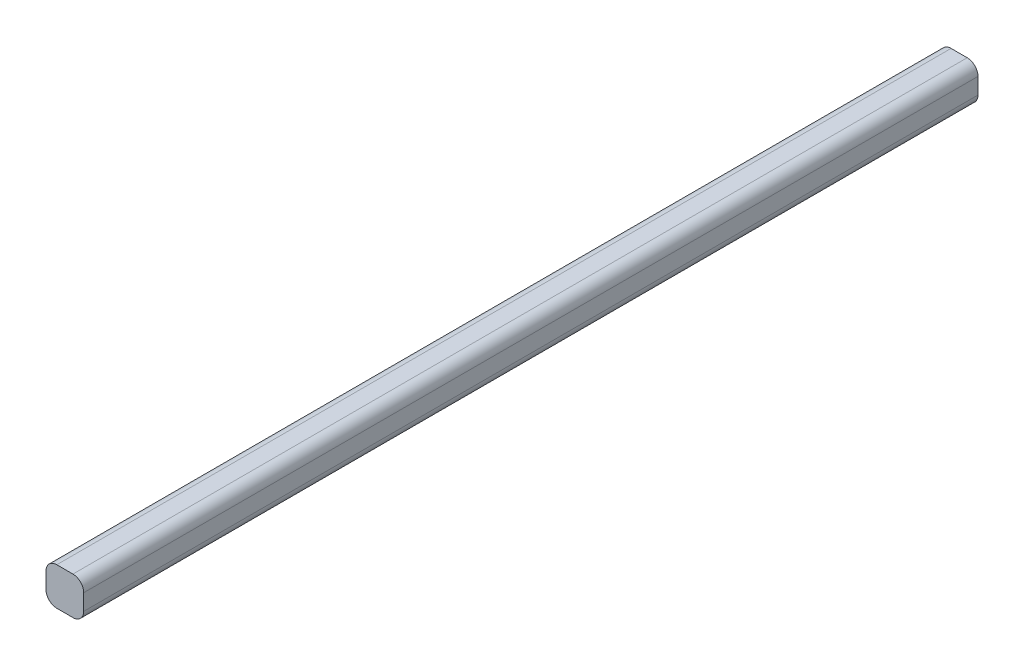
ISO-10303-21;
HEADER;
FILE_DESCRIPTION(('STEP AP214'),'2;1');
FILE_NAME('part.step','',(''),(''),'','','');
FILE_SCHEMA(('AUTOMOTIVE_DESIGN { 1 0 10303 214 1 1 1 1 }'));
ENDSEC;
DATA;
#1=APPLICATION_CONTEXT('core data for automotive mechanical design processes');
#2=APPLICATION_PROTOCOL_DEFINITION('international standard','automotive_design',2000,#1);
#3=PRODUCT_CONTEXT('',#1,'mechanical');
#4=PRODUCT('Part','Part','',(#3));
#5=PRODUCT_RELATED_PRODUCT_CATEGORY('part','',(#4));
#6=PRODUCT_DEFINITION_FORMATION('','',#4);
#7=PRODUCT_DEFINITION_CONTEXT('part definition',#1,'design');
#8=PRODUCT_DEFINITION('design','',#6,#7);
#9=PRODUCT_DEFINITION_SHAPE('','',#8);
#10=(LENGTH_UNIT() NAMED_UNIT(*) SI_UNIT(.MILLI.,.METRE.));
#11=(NAMED_UNIT(*) PLANE_ANGLE_UNIT() SI_UNIT($,.RADIAN.));
#12=(NAMED_UNIT(*) SI_UNIT($,.STERADIAN.) SOLID_ANGLE_UNIT());
#13=UNCERTAINTY_MEASURE_WITH_UNIT(LENGTH_MEASURE(1.E-05),#10,'distance_accuracy_value','');
#14=(GEOMETRIC_REPRESENTATION_CONTEXT(3) GLOBAL_UNCERTAINTY_ASSIGNED_CONTEXT((#13)) GLOBAL_UNIT_ASSIGNED_CONTEXT((#10,
#11,#12)) REPRESENTATION_CONTEXT('',''));
#15=CARTESIAN_POINT('',(0.,0.,0.));
#16=DIRECTION('',(0.,0.,1.));
#17=DIRECTION('',(1.,0.,0.));
#18=AXIS2_PLACEMENT_3D('',#15,#16,#17);
#19=CARTESIAN_POINT('',(0.,0.,830.));
#20=DIRECTION('',(1.,0.,0.));
#21=DIRECTION('',(0.,0.,-1.));
#22=AXIS2_PLACEMENT_3D('',#19,#20,#21);
#23=PLANE('',#22);
#24=DIRECTION('',(0.,-1.,0.));
#25=VECTOR('',#24,1.);
#26=CARTESIAN_POINT('',(0.,0.,0.));
#27=LINE('',#26,#25);
#28=CARTESIAN_POINT('',(0.,25.,0.));
#29=VERTEX_POINT('',#28);
#30=CARTESIAN_POINT('',(0.,10.,0.));
#31=VERTEX_POINT('',#30);
#32=EDGE_CURVE('E133',#29,#31,#27,.T.);
#33=ORIENTED_EDGE('',*,*,#32,.T.);
#34=DIRECTION('',(0.,0.,-1.));
#35=VECTOR('',#34,1.);
#36=CARTESIAN_POINT('',(0.,10.,830.));
#37=LINE('',#36,#35);
#38=CARTESIAN_POINT('',(0.,10.,830.));
#39=VERTEX_POINT('',#38);
#40=EDGE_CURVE('E110',#31,#39,#37,.F.);
#41=ORIENTED_EDGE('',*,*,#40,.T.);
#42=DIRECTION('',(0.,-1.,0.));
#43=VECTOR('',#42,1.);
#44=CARTESIAN_POINT('',(0.,0.,830.));
#45=LINE('',#44,#43);
#46=CARTESIAN_POINT('',(0.,25.,830.));
#47=VERTEX_POINT('',#46);
#48=EDGE_CURVE('E142',#47,#39,#45,.T.);
#49=ORIENTED_EDGE('',*,*,#48,.F.);
#50=DIRECTION('',(0.,0.,-1.));
#51=VECTOR('',#50,1.);
#52=CARTESIAN_POINT('',(0.,25.,830.));
#53=LINE('',#52,#51);
#54=EDGE_CURVE('E115',#47,#29,#53,.T.);
#55=ORIENTED_EDGE('',*,*,#54,.T.);
#56=EDGE_LOOP('',(#33,#41,#49,#55));
#57=FACE_BOUND('',#56,.T.);
#58=ADVANCED_FACE('F38',(#57),#23,.F.);
#59=CARTESIAN_POINT('',(0.,0.,830.));
#60=DIRECTION('',(0.,1.,0.));
#61=DIRECTION('',(0.,0.,1.));
#62=AXIS2_PLACEMENT_3D('',#59,#60,#61);
#63=PLANE('',#62);
#64=DIRECTION('',(1.,0.,0.));
#65=VECTOR('',#64,1.);
#66=CARTESIAN_POINT('',(0.,0.,830.));
#67=LINE('',#66,#65);
#68=CARTESIAN_POINT('',(10.,0.,830.));
#69=VERTEX_POINT('',#68);
#70=CARTESIAN_POINT('',(25.,0.,830.));
#71=VERTEX_POINT('',#70);
#72=EDGE_CURVE('E125',#69,#71,#67,.T.);
#73=ORIENTED_EDGE('',*,*,#72,.F.);
#74=DIRECTION('',(0.,0.,-1.));
#75=VECTOR('',#74,1.);
#76=CARTESIAN_POINT('',(10.,0.,830.));
#77=LINE('',#76,#75);
#78=CARTESIAN_POINT('',(10.,0.,0.));
#79=VERTEX_POINT('',#78);
#80=EDGE_CURVE('E109',#69,#79,#77,.T.);
#81=ORIENTED_EDGE('',*,*,#80,.T.);
#82=DIRECTION('',(1.,0.,0.));
#83=VECTOR('',#82,1.);
#84=CARTESIAN_POINT('',(0.,0.,0.));
#85=LINE('',#84,#83);
#86=CARTESIAN_POINT('',(25.,0.,0.));
#87=VERTEX_POINT('',#86);
#88=EDGE_CURVE('E122',#79,#87,#85,.T.);
#89=ORIENTED_EDGE('',*,*,#88,.T.);
#90=DIRECTION('',(0.,0.,-1.));
#91=VECTOR('',#90,1.);
#92=CARTESIAN_POINT('',(25.,0.,830.));
#93=LINE('',#92,#91);
#94=EDGE_CURVE('E127',#87,#71,#93,.F.);
#95=ORIENTED_EDGE('',*,*,#94,.T.);
#96=EDGE_LOOP('',(#73,#81,#89,#95));
#97=FACE_BOUND('',#96,.T.);
#98=ADVANCED_FACE('F121',(#97),#63,.F.);
#99=CARTESIAN_POINT('',(35.,0.,830.));
#100=DIRECTION('',(-1.,0.,0.));
#101=DIRECTION('',(0.,0.,1.));
#102=AXIS2_PLACEMENT_3D('',#99,#100,#101);
#103=PLANE('',#102);
#104=DIRECTION('',(0.,1.,0.));
#105=VECTOR('',#104,1.);
#106=CARTESIAN_POINT('',(35.,0.,830.));
#107=LINE('',#106,#105);
#108=CARTESIAN_POINT('',(35.,10.,830.));
#109=VERTEX_POINT('',#108);
#110=CARTESIAN_POINT('',(35.,25.,830.));
#111=VERTEX_POINT('',#110);
#112=EDGE_CURVE('E165',#109,#111,#107,.T.);
#113=ORIENTED_EDGE('',*,*,#112,.F.);
#114=DIRECTION('',(0.,0.,-1.));
#115=VECTOR('',#114,1.);
#116=CARTESIAN_POINT('',(35.,10.,830.));
#117=LINE('',#116,#115);
#118=CARTESIAN_POINT('',(35.,10.,0.));
#119=VERTEX_POINT('',#118);
#120=EDGE_CURVE('E11',#109,#119,#117,.T.);
#121=ORIENTED_EDGE('',*,*,#120,.T.);
#122=DIRECTION('',(0.,1.,0.));
#123=VECTOR('',#122,1.);
#124=CARTESIAN_POINT('',(35.,0.,0.));
#125=LINE('',#124,#123);
#126=CARTESIAN_POINT('',(35.,25.,0.));
#127=VERTEX_POINT('',#126);
#128=EDGE_CURVE('E132',#119,#127,#125,.T.);
#129=ORIENTED_EDGE('',*,*,#128,.T.);
#130=DIRECTION('',(0.,0.,-1.));
#131=VECTOR('',#130,1.);
#132=CARTESIAN_POINT('',(35.,25.,830.));
#133=LINE('',#132,#131);
#134=EDGE_CURVE('E46',#127,#111,#133,.F.);
#135=ORIENTED_EDGE('',*,*,#134,.T.);
#136=EDGE_LOOP('',(#113,#121,#129,#135));
#137=FACE_BOUND('',#136,.T.);
#138=ADVANCED_FACE('F164',(#137),#103,.F.);
#139=CARTESIAN_POINT('',(0.,35.,830.));
#140=DIRECTION('',(0.,-1.,0.));
#141=DIRECTION('',(0.,0.,-1.));
#142=AXIS2_PLACEMENT_3D('',#139,#140,#141);
#143=PLANE('',#142);
#144=DIRECTION('',(-1.,0.,0.));
#145=VECTOR('',#144,1.);
#146=CARTESIAN_POINT('',(0.,35.,0.));
#147=LINE('',#146,#145);
#148=CARTESIAN_POINT('',(25.,35.,0.));
#149=VERTEX_POINT('',#148);
#150=CARTESIAN_POINT('',(10.,35.,0.));
#151=VERTEX_POINT('',#150);
#152=EDGE_CURVE('E136',#149,#151,#147,.T.);
#153=ORIENTED_EDGE('',*,*,#152,.T.);
#154=DIRECTION('',(0.,0.,-1.));
#155=VECTOR('',#154,1.);
#156=CARTESIAN_POINT('',(10.,35.,830.));
#157=LINE('',#156,#155);
#158=CARTESIAN_POINT('',(10.,35.,830.));
#159=VERTEX_POINT('',#158);
#160=EDGE_CURVE('E53',#151,#159,#157,.F.);
#161=ORIENTED_EDGE('',*,*,#160,.T.);
#162=DIRECTION('',(-1.,0.,0.));
#163=VECTOR('',#162,1.);
#164=CARTESIAN_POINT('',(0.,35.,830.));
#165=LINE('',#164,#163);
#166=CARTESIAN_POINT('',(25.,35.,830.));
#167=VERTEX_POINT('',#166);
#168=EDGE_CURVE('E143',#167,#159,#165,.T.);
#169=ORIENTED_EDGE('',*,*,#168,.F.);
#170=DIRECTION('',(0.,0.,-1.));
#171=VECTOR('',#170,1.);
#172=CARTESIAN_POINT('',(25.,35.,830.));
#173=LINE('',#172,#171);
#174=EDGE_CURVE('E158',#167,#149,#173,.T.);
#175=ORIENTED_EDGE('',*,*,#174,.T.);
#176=EDGE_LOOP('',(#153,#161,#169,#175));
#177=FACE_BOUND('',#176,.T.);
#178=ADVANCED_FACE('F174',(#177),#143,.F.);
#179=CARTESIAN_POINT('',(0.,0.,830.));
#180=DIRECTION('',(0.,0.,-1.));
#181=DIRECTION('',(-1.,0.,0.));
#182=AXIS2_PLACEMENT_3D('',#179,#180,#181);
#183=PLANE('',#182);
#184=ORIENTED_EDGE('',*,*,#48,.T.);
#185=CARTESIAN_POINT('',(10.,10.,830.));
#186=DIRECTION('',(0.,0.,-1.));
#187=DIRECTION('',(-1.,0.,0.));
#188=AXIS2_PLACEMENT_3D('',#185,#186,#187);
#189=CIRCLE('',#188,10.);
#190=EDGE_CURVE('E156',#39,#69,#189,.F.);
#191=ORIENTED_EDGE('',*,*,#190,.T.);
#192=ORIENTED_EDGE('',*,*,#72,.T.);
#193=CARTESIAN_POINT('',(25.,10.,830.));
#194=DIRECTION('',(0.,0.,-1.));
#195=DIRECTION('',(-1.,0.,0.));
#196=AXIS2_PLACEMENT_3D('',#193,#194,#195);
#197=CIRCLE('',#196,10.);
#198=EDGE_CURVE('E152',#71,#109,#197,.F.);
#199=ORIENTED_EDGE('',*,*,#198,.T.);
#200=ORIENTED_EDGE('',*,*,#112,.T.);
#201=CARTESIAN_POINT('',(25.,25.,830.));
#202=DIRECTION('',(0.,0.,-1.));
#203=DIRECTION('',(-1.,0.,0.));
#204=AXIS2_PLACEMENT_3D('',#201,#202,#203);
#205=CIRCLE('',#204,10.);
#206=EDGE_CURVE('E60',#111,#167,#205,.F.);
#207=ORIENTED_EDGE('',*,*,#206,.T.);
#208=ORIENTED_EDGE('',*,*,#168,.T.);
#209=CARTESIAN_POINT('',(10.,25.,830.));
#210=DIRECTION('',(0.,0.,-1.));
#211=DIRECTION('',(-1.,0.,0.));
#212=AXIS2_PLACEMENT_3D('',#209,#210,#211);
#213=CIRCLE('',#212,10.);
#214=EDGE_CURVE('E154',#159,#47,#213,.F.);
#215=ORIENTED_EDGE('',*,*,#214,.T.);
#216=EDGE_LOOP('',(#184,#191,#192,#199,#200,#207,#208,#215));
#217=FACE_BOUND('',#216,.T.);
#218=ADVANCED_FACE('F169',(#217),#183,.F.);
#219=CARTESIAN_POINT('',(0.,0.,0.));
#220=DIRECTION('',(0.,0.,-1.));
#221=DIRECTION('',(-1.,0.,0.));
#222=AXIS2_PLACEMENT_3D('',#219,#220,#221);
#223=PLANE('',#222);
#224=ORIENTED_EDGE('',*,*,#88,.F.);
#225=CARTESIAN_POINT('',(10.,10.,0.));
#226=DIRECTION('',(0.,0.,-1.));
#227=DIRECTION('',(-1.,0.,0.));
#228=AXIS2_PLACEMENT_3D('',#225,#226,#227);
#229=CIRCLE('',#228,10.);
#230=EDGE_CURVE('E105',#79,#31,#229,.T.);
#231=ORIENTED_EDGE('',*,*,#230,.T.);
#232=ORIENTED_EDGE('',*,*,#32,.F.);
#233=CARTESIAN_POINT('',(10.,25.,0.));
#234=DIRECTION('',(0.,0.,-1.));
#235=DIRECTION('',(-1.,0.,0.));
#236=AXIS2_PLACEMENT_3D('',#233,#234,#235);
#237=CIRCLE('',#236,10.);
#238=EDGE_CURVE('E116',#29,#151,#237,.T.);
#239=ORIENTED_EDGE('',*,*,#238,.T.);
#240=ORIENTED_EDGE('',*,*,#152,.F.);
#241=CARTESIAN_POINT('',(25.,25.,0.));
#242=DIRECTION('',(0.,0.,-1.));
#243=DIRECTION('',(-1.,0.,0.));
#244=AXIS2_PLACEMENT_3D('',#241,#242,#243);
#245=CIRCLE('',#244,10.);
#246=EDGE_CURVE('E126',#149,#127,#245,.T.);
#247=ORIENTED_EDGE('',*,*,#246,.T.);
#248=ORIENTED_EDGE('',*,*,#128,.F.);
#249=CARTESIAN_POINT('',(25.,10.,0.));
#250=DIRECTION('',(0.,0.,-1.));
#251=DIRECTION('',(-1.,0.,0.));
#252=AXIS2_PLACEMENT_3D('',#249,#250,#251);
#253=CIRCLE('',#252,10.);
#254=EDGE_CURVE('E131',#119,#87,#253,.T.);
#255=ORIENTED_EDGE('',*,*,#254,.T.);
#256=EDGE_LOOP('',(#224,#231,#232,#239,#240,#247,#248,#255));
#257=FACE_BOUND('',#256,.T.);
#258=ADVANCED_FACE('F129',(#257),#223,.T.);
#259=CARTESIAN_POINT('',(10.,10.,830.));
#260=DIRECTION('',(0.,0.,-1.));
#261=DIRECTION('',(-1.,0.,0.));
#262=AXIS2_PLACEMENT_3D('',#259,#260,#261);
#263=CYLINDRICAL_SURFACE('',#262,10.);
#264=ORIENTED_EDGE('',*,*,#190,.F.);
#265=ORIENTED_EDGE('',*,*,#40,.F.);
#266=ORIENTED_EDGE('',*,*,#230,.F.);
#267=ORIENTED_EDGE('',*,*,#80,.F.);
#268=EDGE_LOOP('',(#264,#265,#266,#267));
#269=FACE_BOUND('',#268,.T.);
#270=ADVANCED_FACE('F108',(#269),#263,.T.);
#271=CARTESIAN_POINT('',(10.,25.,830.));
#272=DIRECTION('',(0.,0.,-1.));
#273=DIRECTION('',(-1.,0.,0.));
#274=AXIS2_PLACEMENT_3D('',#271,#272,#273);
#275=CYLINDRICAL_SURFACE('',#274,10.);
#276=ORIENTED_EDGE('',*,*,#214,.F.);
#277=ORIENTED_EDGE('',*,*,#160,.F.);
#278=ORIENTED_EDGE('',*,*,#238,.F.);
#279=ORIENTED_EDGE('',*,*,#54,.F.);
#280=EDGE_LOOP('',(#276,#277,#278,#279));
#281=FACE_BOUND('',#280,.T.);
#282=ADVANCED_FACE('F178',(#281),#275,.T.);
#283=CARTESIAN_POINT('',(25.,10.,830.));
#284=DIRECTION('',(0.,0.,-1.));
#285=DIRECTION('',(-1.,0.,0.));
#286=AXIS2_PLACEMENT_3D('',#283,#284,#285);
#287=CYLINDRICAL_SURFACE('',#286,10.);
#288=ORIENTED_EDGE('',*,*,#198,.F.);
#289=ORIENTED_EDGE('',*,*,#94,.F.);
#290=ORIENTED_EDGE('',*,*,#254,.F.);
#291=ORIENTED_EDGE('',*,*,#120,.F.);
#292=EDGE_LOOP('',(#288,#289,#290,#291));
#293=FACE_BOUND('',#292,.T.);
#294=ADVANCED_FACE('F184',(#293),#287,.T.);
#295=CARTESIAN_POINT('',(25.,25.,830.));
#296=DIRECTION('',(0.,0.,-1.));
#297=DIRECTION('',(-1.,0.,0.));
#298=AXIS2_PLACEMENT_3D('',#295,#296,#297);
#299=CYLINDRICAL_SURFACE('',#298,10.);
#300=ORIENTED_EDGE('',*,*,#206,.F.);
#301=ORIENTED_EDGE('',*,*,#134,.F.);
#302=ORIENTED_EDGE('',*,*,#246,.F.);
#303=ORIENTED_EDGE('',*,*,#174,.F.);
#304=EDGE_LOOP('',(#300,#301,#302,#303));
#305=FACE_BOUND('',#304,.T.);
#306=ADVANCED_FACE('F40',(#305),#299,.T.);
#307=CLOSED_SHELL('',(#58,#98,#138,#178,#218,#258,#270,#282,#294,#306));
#308=MANIFOLD_SOLID_BREP('B2',#307);
#309=ADVANCED_BREP_SHAPE_REPRESENTATION('',(#18,#308),#14);
#310=SHAPE_DEFINITION_REPRESENTATION(#9,#309);
ENDSEC;
END-ISO-10303-21;
